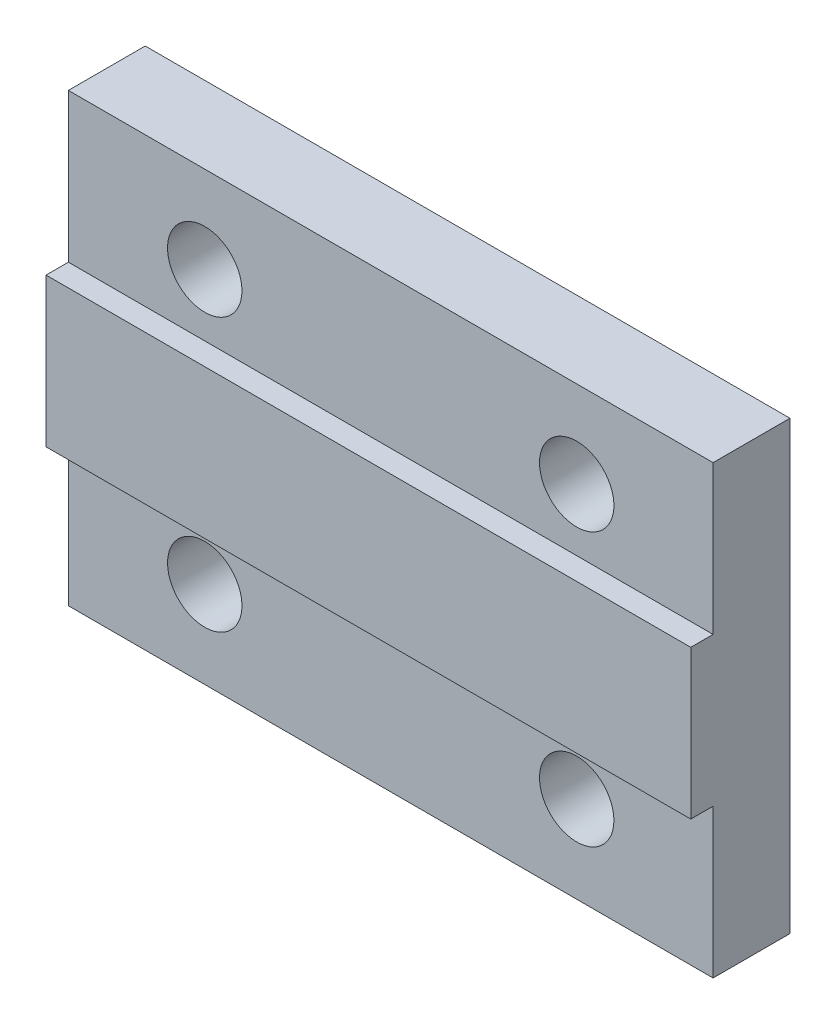
ISO-10303-21;
HEADER;
FILE_DESCRIPTION(('STEP AP214'),'2;1');
FILE_NAME('part.step','',(''),(''),'','','');
FILE_SCHEMA(('AUTOMOTIVE_DESIGN { 1 0 10303 214 1 1 1 1 }'));
ENDSEC;
DATA;
#1=APPLICATION_CONTEXT('core data for automotive mechanical design processes');
#2=APPLICATION_PROTOCOL_DEFINITION('international standard','automotive_design',2000,#1);
#3=PRODUCT_CONTEXT('',#1,'mechanical');
#4=PRODUCT('Part','Part','',(#3));
#5=PRODUCT_RELATED_PRODUCT_CATEGORY('part','',(#4));
#6=PRODUCT_DEFINITION_FORMATION('','',#4);
#7=PRODUCT_DEFINITION_CONTEXT('part definition',#1,'design');
#8=PRODUCT_DEFINITION('design','',#6,#7);
#9=PRODUCT_DEFINITION_SHAPE('','',#8);
#10=(LENGTH_UNIT() NAMED_UNIT(*) SI_UNIT(.MILLI.,.METRE.));
#11=(NAMED_UNIT(*) PLANE_ANGLE_UNIT() SI_UNIT($,.RADIAN.));
#12=(NAMED_UNIT(*) SI_UNIT($,.STERADIAN.) SOLID_ANGLE_UNIT());
#13=UNCERTAINTY_MEASURE_WITH_UNIT(LENGTH_MEASURE(1.E-05),#10,'distance_accuracy_value','');
#14=(GEOMETRIC_REPRESENTATION_CONTEXT(3) GLOBAL_UNCERTAINTY_ASSIGNED_CONTEXT((#13)) GLOBAL_UNIT_ASSIGNED_CONTEXT((#10,
#11,#12)) REPRESENTATION_CONTEXT('',''));
#15=CARTESIAN_POINT('',(0.,0.,0.));
#16=DIRECTION('',(0.,0.,1.));
#17=DIRECTION('',(1.,0.,0.));
#18=AXIS2_PLACEMENT_3D('',#15,#16,#17);
#19=CARTESIAN_POINT('',(0.,0.,4.));
#20=DIRECTION('',(1.,0.,0.));
#21=DIRECTION('',(0.,0.,-1.));
#22=AXIS2_PLACEMENT_3D('',#19,#20,#21);
#23=PLANE('',#22);
#24=DIRECTION('',(0.,1.,0.));
#25=VECTOR('',#24,1.);
#26=CARTESIAN_POINT('',(0.,0.,3.1));
#27=LINE('',#26,#25);
#28=CARTESIAN_POINT('',(0.,0.,3.1));
#29=VERTEX_POINT('',#28);
#30=CARTESIAN_POINT('',(0.,6.,3.1));
#31=VERTEX_POINT('',#30);
#32=EDGE_CURVE('E98',#29,#31,#27,.T.);
#33=ORIENTED_EDGE('',*,*,#32,.T.);
#34=DIRECTION('',(0.,0.,1.));
#35=VECTOR('',#34,1.);
#36=CARTESIAN_POINT('',(0.,6.,4.));
#37=LINE('',#36,#35);
#38=CARTESIAN_POINT('',(0.,6.,4.));
#39=VERTEX_POINT('',#38);
#40=EDGE_CURVE('E109',#31,#39,#37,.T.);
#41=ORIENTED_EDGE('',*,*,#40,.T.);
#42=DIRECTION('',(0.,-1.,0.));
#43=VECTOR('',#42,1.);
#44=CARTESIAN_POINT('',(0.,0.,4.));
#45=LINE('',#44,#43);
#46=CARTESIAN_POINT('',(0.,12.,4.));
#47=VERTEX_POINT('',#46);
#48=EDGE_CURVE('E142',#47,#39,#45,.T.);
#49=ORIENTED_EDGE('',*,*,#48,.F.);
#50=DIRECTION('',(0.,0.,-1.));
#51=VECTOR('',#50,1.);
#52=CARTESIAN_POINT('',(0.,12.,4.));
#53=LINE('',#52,#51);
#54=CARTESIAN_POINT('',(0.,12.,3.1));
#55=VERTEX_POINT('',#54);
#56=EDGE_CURVE('E57',#47,#55,#53,.T.);
#57=ORIENTED_EDGE('',*,*,#56,.T.);
#58=DIRECTION('',(0.,1.,0.));
#59=VECTOR('',#58,1.);
#60=CARTESIAN_POINT('',(0.,18.,3.1));
#61=LINE('',#60,#59);
#62=CARTESIAN_POINT('',(0.,18.,3.1));
#63=VERTEX_POINT('',#62);
#64=EDGE_CURVE('E161',#55,#63,#61,.T.);
#65=ORIENTED_EDGE('',*,*,#64,.T.);
#66=DIRECTION('',(0.,0.,-1.));
#67=VECTOR('',#66,1.);
#68=CARTESIAN_POINT('',(0.,18.,4.));
#69=LINE('',#68,#67);
#70=CARTESIAN_POINT('',(0.,18.,0.));
#71=VERTEX_POINT('',#70);
#72=EDGE_CURVE('E122',#63,#71,#69,.T.);
#73=ORIENTED_EDGE('',*,*,#72,.T.);
#74=DIRECTION('',(0.,-1.,0.));
#75=VECTOR('',#74,1.);
#76=CARTESIAN_POINT('',(0.,0.,0.));
#77=LINE('',#76,#75);
#78=CARTESIAN_POINT('',(0.,0.,0.));
#79=VERTEX_POINT('',#78);
#80=EDGE_CURVE('E119',#71,#79,#77,.T.);
#81=ORIENTED_EDGE('',*,*,#80,.T.);
#82=DIRECTION('',(0.,0.,-1.));
#83=VECTOR('',#82,1.);
#84=CARTESIAN_POINT('',(0.,0.,4.));
#85=LINE('',#84,#83);
#86=EDGE_CURVE('E11',#29,#79,#85,.T.);
#87=ORIENTED_EDGE('',*,*,#86,.F.);
#88=EDGE_LOOP('',(#33,#41,#49,#57,#65,#73,#81,#87));
#89=FACE_BOUND('',#88,.T.);
#90=ADVANCED_FACE('F35',(#89),#23,.F.);
#91=CARTESIAN_POINT('',(0.,0.,4.));
#92=DIRECTION('',(0.,1.,0.));
#93=DIRECTION('',(0.,0.,1.));
#94=AXIS2_PLACEMENT_3D('',#91,#92,#93);
#95=PLANE('',#94);
#96=DIRECTION('',(0.,0.,-1.));
#97=VECTOR('',#96,1.);
#98=CARTESIAN_POINT('',(26.,0.,4.));
#99=LINE('',#98,#97);
#100=CARTESIAN_POINT('',(26.,0.,3.1));
#101=VERTEX_POINT('',#100);
#102=CARTESIAN_POINT('',(26.,0.,0.));
#103=VERTEX_POINT('',#102);
#104=EDGE_CURVE('E42',#101,#103,#99,.T.);
#105=ORIENTED_EDGE('',*,*,#104,.F.);
#106=DIRECTION('',(1.,0.,0.));
#107=VECTOR('',#106,1.);
#108=CARTESIAN_POINT('',(0.,0.,3.1));
#109=LINE('',#108,#107);
#110=EDGE_CURVE('E102',#29,#101,#109,.T.);
#111=ORIENTED_EDGE('',*,*,#110,.F.);
#112=ORIENTED_EDGE('',*,*,#86,.T.);
#113=DIRECTION('',(1.,0.,0.));
#114=VECTOR('',#113,1.);
#115=CARTESIAN_POINT('',(0.,0.,0.));
#116=LINE('',#115,#114);
#117=EDGE_CURVE('E126',#79,#103,#116,.T.);
#118=ORIENTED_EDGE('',*,*,#117,.T.);
#119=EDGE_LOOP('',(#105,#111,#112,#118));
#120=FACE_BOUND('',#119,.T.);
#121=ADVANCED_FACE('F113',(#120),#95,.F.);
#122=CARTESIAN_POINT('',(26.,0.,4.));
#123=DIRECTION('',(-1.,0.,0.));
#124=DIRECTION('',(0.,0.,1.));
#125=AXIS2_PLACEMENT_3D('',#122,#123,#124);
#126=PLANE('',#125);
#127=DIRECTION('',(0.,1.,0.));
#128=VECTOR('',#127,1.);
#129=CARTESIAN_POINT('',(26.,0.,4.));
#130=LINE('',#129,#128);
#131=CARTESIAN_POINT('',(26.,6.,4.));
#132=VERTEX_POINT('',#131);
#133=CARTESIAN_POINT('',(26.,12.,4.));
#134=VERTEX_POINT('',#133);
#135=EDGE_CURVE('E135',#132,#134,#130,.T.);
#136=ORIENTED_EDGE('',*,*,#135,.F.);
#137=DIRECTION('',(0.,0.,1.));
#138=VECTOR('',#137,1.);
#139=CARTESIAN_POINT('',(26.,6.,4.));
#140=LINE('',#139,#138);
#141=CARTESIAN_POINT('',(26.,6.,3.1));
#142=VERTEX_POINT('',#141);
#143=EDGE_CURVE('E49',#142,#132,#140,.T.);
#144=ORIENTED_EDGE('',*,*,#143,.F.);
#145=DIRECTION('',(0.,1.,0.));
#146=VECTOR('',#145,1.);
#147=CARTESIAN_POINT('',(26.,0.,3.1));
#148=LINE('',#147,#146);
#149=EDGE_CURVE('E150',#101,#142,#148,.T.);
#150=ORIENTED_EDGE('',*,*,#149,.F.);
#151=ORIENTED_EDGE('',*,*,#104,.T.);
#152=DIRECTION('',(0.,1.,0.));
#153=VECTOR('',#152,1.);
#154=CARTESIAN_POINT('',(26.,0.,0.));
#155=LINE('',#154,#153);
#156=CARTESIAN_POINT('',(26.,18.,0.));
#157=VERTEX_POINT('',#156);
#158=EDGE_CURVE('E129',#103,#157,#155,.T.);
#159=ORIENTED_EDGE('',*,*,#158,.T.);
#160=DIRECTION('',(0.,0.,-1.));
#161=VECTOR('',#160,1.);
#162=CARTESIAN_POINT('',(26.,18.,4.));
#163=LINE('',#162,#161);
#164=CARTESIAN_POINT('',(26.,18.,3.1));
#165=VERTEX_POINT('',#164);
#166=EDGE_CURVE('E144',#165,#157,#163,.T.);
#167=ORIENTED_EDGE('',*,*,#166,.F.);
#168=DIRECTION('',(0.,1.,0.));
#169=VECTOR('',#168,1.);
#170=CARTESIAN_POINT('',(26.,18.,3.1));
#171=LINE('',#170,#169);
#172=CARTESIAN_POINT('',(26.,12.,3.1));
#173=VERTEX_POINT('',#172);
#174=EDGE_CURVE('E156',#173,#165,#171,.T.);
#175=ORIENTED_EDGE('',*,*,#174,.F.);
#176=DIRECTION('',(0.,0.,-1.));
#177=VECTOR('',#176,1.);
#178=CARTESIAN_POINT('',(26.,12.,4.));
#179=LINE('',#178,#177);
#180=EDGE_CURVE('E158',#134,#173,#179,.T.);
#181=ORIENTED_EDGE('',*,*,#180,.F.);
#182=EDGE_LOOP('',(#136,#144,#150,#151,#159,#167,#175,#181));
#183=FACE_BOUND('',#182,.T.);
#184=ADVANCED_FACE('F147',(#183),#126,.F.);
#185=CARTESIAN_POINT('',(0.,18.,4.));
#186=DIRECTION('',(0.,-1.,0.));
#187=DIRECTION('',(0.,0.,-1.));
#188=AXIS2_PLACEMENT_3D('',#185,#186,#187);
#189=PLANE('',#188);
#190=ORIENTED_EDGE('',*,*,#72,.F.);
#191=DIRECTION('',(1.,0.,0.));
#192=VECTOR('',#191,1.);
#193=CARTESIAN_POINT('',(0.,18.,3.1));
#194=LINE('',#193,#192);
#195=EDGE_CURVE('E127',#63,#165,#194,.T.);
#196=ORIENTED_EDGE('',*,*,#195,.T.);
#197=ORIENTED_EDGE('',*,*,#166,.T.);
#198=DIRECTION('',(-1.,0.,0.));
#199=VECTOR('',#198,1.);
#200=CARTESIAN_POINT('',(0.,18.,0.));
#201=LINE('',#200,#199);
#202=EDGE_CURVE('E140',#157,#71,#201,.T.);
#203=ORIENTED_EDGE('',*,*,#202,.T.);
#204=EDGE_LOOP('',(#190,#196,#197,#203));
#205=FACE_BOUND('',#204,.T.);
#206=ADVANCED_FACE('F153',(#205),#189,.F.);
#207=CARTESIAN_POINT('',(0.,0.,4.));
#208=DIRECTION('',(0.,0.,-1.));
#209=DIRECTION('',(-1.,0.,0.));
#210=AXIS2_PLACEMENT_3D('',#207,#208,#209);
#211=PLANE('',#210);
#212=ORIENTED_EDGE('',*,*,#48,.T.);
#213=DIRECTION('',(1.,0.,0.));
#214=VECTOR('',#213,1.);
#215=CARTESIAN_POINT('',(0.,6.,4.));
#216=LINE('',#215,#214);
#217=EDGE_CURVE('E163',#39,#132,#216,.T.);
#218=ORIENTED_EDGE('',*,*,#217,.T.);
#219=ORIENTED_EDGE('',*,*,#135,.T.);
#220=DIRECTION('',(1.,0.,0.));
#221=VECTOR('',#220,1.);
#222=CARTESIAN_POINT('',(0.,12.,4.));
#223=LINE('',#222,#221);
#224=EDGE_CURVE('E168',#47,#134,#223,.T.);
#225=ORIENTED_EDGE('',*,*,#224,.F.);
#226=EDGE_LOOP('',(#212,#218,#219,#225));
#227=FACE_BOUND('',#226,.T.);
#228=ADVANCED_FACE('F172',(#227),#211,.F.);
#229=CARTESIAN_POINT('',(0.,0.,0.));
#230=DIRECTION('',(0.,0.,-1.));
#231=DIRECTION('',(-1.,0.,0.));
#232=AXIS2_PLACEMENT_3D('',#229,#230,#231);
#233=PLANE('',#232);
#234=CARTESIAN_POINT('',(5.5,3.5,0.));
#235=DIRECTION('',(0.,0.,-1.));
#236=DIRECTION('',(-1.,0.,0.));
#237=AXIS2_PLACEMENT_3D('',#234,#235,#236);
#238=CIRCLE('',#237,1.5);
#239=CARTESIAN_POINT('',(4.,3.5,0.));
#240=VERTEX_POINT('',#239);
#241=EDGE_CURVE('E227',#240,#240,#238,.T.);
#242=ORIENTED_EDGE('',*,*,#241,.F.);
#243=EDGE_LOOP('',(#242));
#244=FACE_BOUND('',#243,.T.);
#245=CARTESIAN_POINT('',(20.5,3.5,0.));
#246=DIRECTION('',(0.,0.,-1.));
#247=DIRECTION('',(-1.,0.,0.));
#248=AXIS2_PLACEMENT_3D('',#245,#246,#247);
#249=CIRCLE('',#248,1.5);
#250=CARTESIAN_POINT('',(19.,3.5,0.));
#251=VERTEX_POINT('',#250);
#252=EDGE_CURVE('E232',#251,#251,#249,.T.);
#253=ORIENTED_EDGE('',*,*,#252,.F.);
#254=EDGE_LOOP('',(#253));
#255=FACE_BOUND('',#254,.T.);
#256=CARTESIAN_POINT('',(20.5,14.5,0.));
#257=DIRECTION('',(0.,0.,-1.));
#258=DIRECTION('',(-1.,0.,0.));
#259=AXIS2_PLACEMENT_3D('',#256,#257,#258);
#260=CIRCLE('',#259,1.5);
#261=CARTESIAN_POINT('',(19.,14.5,0.));
#262=VERTEX_POINT('',#261);
#263=EDGE_CURVE('E223',#262,#262,#260,.T.);
#264=ORIENTED_EDGE('',*,*,#263,.F.);
#265=EDGE_LOOP('',(#264));
#266=FACE_BOUND('',#265,.T.);
#267=CARTESIAN_POINT('',(5.5,14.5,0.));
#268=DIRECTION('',(0.,0.,-1.));
#269=DIRECTION('',(-1.,0.,0.));
#270=AXIS2_PLACEMENT_3D('',#267,#268,#269);
#271=CIRCLE('',#270,1.5);
#272=CARTESIAN_POINT('',(4.,14.5,0.));
#273=VERTEX_POINT('',#272);
#274=EDGE_CURVE('E180',#273,#273,#271,.T.);
#275=ORIENTED_EDGE('',*,*,#274,.F.);
#276=EDGE_LOOP('',(#275));
#277=FACE_BOUND('',#276,.T.);
#278=ORIENTED_EDGE('',*,*,#80,.F.);
#279=ORIENTED_EDGE('',*,*,#202,.F.);
#280=ORIENTED_EDGE('',*,*,#158,.F.);
#281=ORIENTED_EDGE('',*,*,#117,.F.);
#282=EDGE_LOOP('',(#278,#279,#280,#281));
#283=FACE_BOUND('',#282,.T.);
#284=ADVANCED_FACE('F151',(#244,#255,#266,#277,#283),#233,.T.);
#285=CARTESIAN_POINT('',(0.,18.,3.1));
#286=DIRECTION('',(0.,0.,-1.));
#287=DIRECTION('',(0.,1.,0.));
#288=AXIS2_PLACEMENT_3D('',#285,#286,#287);
#289=PLANE('',#288);
#290=CARTESIAN_POINT('',(20.5,14.5,3.1));
#291=DIRECTION('',(0.,0.,1.));
#292=DIRECTION('',(-1.,0.,0.));
#293=AXIS2_PLACEMENT_3D('',#290,#291,#292);
#294=CIRCLE('',#293,1.5);
#295=CARTESIAN_POINT('',(19.,14.5,3.1));
#296=VERTEX_POINT('',#295);
#297=EDGE_CURVE('E218',#296,#296,#294,.T.);
#298=ORIENTED_EDGE('',*,*,#297,.F.);
#299=EDGE_LOOP('',(#298));
#300=FACE_BOUND('',#299,.T.);
#301=CARTESIAN_POINT('',(5.5,14.5,3.1));
#302=DIRECTION('',(0.,0.,1.));
#303=DIRECTION('',(1.,0.,0.));
#304=AXIS2_PLACEMENT_3D('',#301,#302,#303);
#305=CIRCLE('',#304,1.5);
#306=CARTESIAN_POINT('',(7.,14.5,3.1));
#307=VERTEX_POINT('',#306);
#308=EDGE_CURVE('E221',#307,#307,#305,.T.);
#309=ORIENTED_EDGE('',*,*,#308,.F.);
#310=EDGE_LOOP('',(#309));
#311=FACE_BOUND('',#310,.T.);
#312=ORIENTED_EDGE('',*,*,#174,.T.);
#313=ORIENTED_EDGE('',*,*,#195,.F.);
#314=ORIENTED_EDGE('',*,*,#64,.F.);
#315=DIRECTION('',(1.,0.,0.));
#316=VECTOR('',#315,1.);
#317=CARTESIAN_POINT('',(0.,12.,3.1));
#318=LINE('',#317,#316);
#319=EDGE_CURVE('E132',#55,#173,#318,.T.);
#320=ORIENTED_EDGE('',*,*,#319,.T.);
#321=EDGE_LOOP('',(#312,#313,#314,#320));
#322=FACE_BOUND('',#321,.T.);
#323=ADVANCED_FACE('F175',(#300,#311,#322),#289,.F.);
#324=CARTESIAN_POINT('',(0.,12.,4.));
#325=DIRECTION('',(0.,-1.,0.));
#326=DIRECTION('',(0.,0.,-1.));
#327=AXIS2_PLACEMENT_3D('',#324,#325,#326);
#328=PLANE('',#327);
#329=ORIENTED_EDGE('',*,*,#180,.T.);
#330=ORIENTED_EDGE('',*,*,#319,.F.);
#331=ORIENTED_EDGE('',*,*,#56,.F.);
#332=ORIENTED_EDGE('',*,*,#224,.T.);
#333=EDGE_LOOP('',(#329,#330,#331,#332));
#334=FACE_BOUND('',#333,.T.);
#335=ADVANCED_FACE('F173',(#334),#328,.F.);
#336=CARTESIAN_POINT('',(0.,6.,4.));
#337=DIRECTION('',(0.,1.,0.));
#338=DIRECTION('',(0.,0.,1.));
#339=AXIS2_PLACEMENT_3D('',#336,#337,#338);
#340=PLANE('',#339);
#341=ORIENTED_EDGE('',*,*,#143,.T.);
#342=ORIENTED_EDGE('',*,*,#217,.F.);
#343=ORIENTED_EDGE('',*,*,#40,.F.);
#344=DIRECTION('',(1.,0.,0.));
#345=VECTOR('',#344,1.);
#346=CARTESIAN_POINT('',(0.,6.,3.1));
#347=LINE('',#346,#345);
#348=EDGE_CURVE('E104',#31,#142,#347,.T.);
#349=ORIENTED_EDGE('',*,*,#348,.T.);
#350=EDGE_LOOP('',(#341,#342,#343,#349));
#351=FACE_BOUND('',#350,.T.);
#352=ADVANCED_FACE('F183',(#351),#340,.F.);
#353=CARTESIAN_POINT('',(0.,0.,3.1));
#354=DIRECTION('',(0.,0.,-1.));
#355=DIRECTION('',(0.,1.,0.));
#356=AXIS2_PLACEMENT_3D('',#353,#354,#355);
#357=PLANE('',#356);
#358=CARTESIAN_POINT('',(5.5,3.5,3.1));
#359=DIRECTION('',(0.,0.,1.));
#360=DIRECTION('',(-1.,0.,0.));
#361=AXIS2_PLACEMENT_3D('',#358,#359,#360);
#362=CIRCLE('',#361,1.5);
#363=CARTESIAN_POINT('',(4.,3.5,3.1));
#364=VERTEX_POINT('',#363);
#365=EDGE_CURVE('E235',#364,#364,#362,.T.);
#366=ORIENTED_EDGE('',*,*,#365,.F.);
#367=EDGE_LOOP('',(#366));
#368=FACE_BOUND('',#367,.T.);
#369=CARTESIAN_POINT('',(20.5,3.5,3.1));
#370=DIRECTION('',(0.,0.,1.));
#371=DIRECTION('',(1.,0.,0.));
#372=AXIS2_PLACEMENT_3D('',#369,#370,#371);
#373=CIRCLE('',#372,1.5);
#374=CARTESIAN_POINT('',(22.,3.5,3.1));
#375=VERTEX_POINT('',#374);
#376=EDGE_CURVE('E237',#375,#375,#373,.T.);
#377=ORIENTED_EDGE('',*,*,#376,.F.);
#378=EDGE_LOOP('',(#377));
#379=FACE_BOUND('',#378,.T.);
#380=ORIENTED_EDGE('',*,*,#149,.T.);
#381=ORIENTED_EDGE('',*,*,#348,.F.);
#382=ORIENTED_EDGE('',*,*,#32,.F.);
#383=ORIENTED_EDGE('',*,*,#110,.T.);
#384=EDGE_LOOP('',(#380,#381,#382,#383));
#385=FACE_BOUND('',#384,.T.);
#386=ADVANCED_FACE('F101',(#368,#379,#385),#357,.F.);
#387=CARTESIAN_POINT('',(5.5,14.5,-0.899999999999999));
#388=DIRECTION('',(0.,0.,1.));
#389=DIRECTION('',(1.,0.,0.));
#390=AXIS2_PLACEMENT_3D('',#387,#388,#389);
#391=CYLINDRICAL_SURFACE('',#390,1.5);
#392=ORIENTED_EDGE('',*,*,#274,.T.);
#393=EDGE_LOOP('',(#392));
#394=FACE_BOUND('',#393,.T.);
#395=ORIENTED_EDGE('',*,*,#308,.T.);
#396=EDGE_LOOP('',(#395));
#397=FACE_BOUND('',#396,.T.);
#398=ADVANCED_FACE('F190',(#394,#397),#391,.F.);
#399=CARTESIAN_POINT('',(20.5,3.5,-0.899999999999999));
#400=DIRECTION('',(0.,0.,1.));
#401=DIRECTION('',(1.,0.,0.));
#402=AXIS2_PLACEMENT_3D('',#399,#400,#401);
#403=CYLINDRICAL_SURFACE('',#402,1.5);
#404=ORIENTED_EDGE('',*,*,#252,.T.);
#405=EDGE_LOOP('',(#404));
#406=FACE_BOUND('',#405,.T.);
#407=ORIENTED_EDGE('',*,*,#376,.T.);
#408=EDGE_LOOP('',(#407));
#409=FACE_BOUND('',#408,.T.);
#410=ADVANCED_FACE('F247',(#406,#409),#403,.F.);
#411=CARTESIAN_POINT('',(5.5,3.5,-0.899999999999999));
#412=DIRECTION('',(0.,0.,1.));
#413=DIRECTION('',(1.,0.,0.));
#414=AXIS2_PLACEMENT_3D('',#411,#412,#413);
#415=CYLINDRICAL_SURFACE('',#414,1.5);
#416=ORIENTED_EDGE('',*,*,#241,.T.);
#417=EDGE_LOOP('',(#416));
#418=FACE_BOUND('',#417,.T.);
#419=ORIENTED_EDGE('',*,*,#365,.T.);
#420=EDGE_LOOP('',(#419));
#421=FACE_BOUND('',#420,.T.);
#422=ADVANCED_FACE('F243',(#418,#421),#415,.F.);
#423=CARTESIAN_POINT('',(20.5,14.5,-0.899999999999999));
#424=DIRECTION('',(0.,0.,1.));
#425=DIRECTION('',(1.,0.,0.));
#426=AXIS2_PLACEMENT_3D('',#423,#424,#425);
#427=CYLINDRICAL_SURFACE('',#426,1.5);
#428=ORIENTED_EDGE('',*,*,#263,.T.);
#429=EDGE_LOOP('',(#428));
#430=FACE_BOUND('',#429,.T.);
#431=ORIENTED_EDGE('',*,*,#297,.T.);
#432=EDGE_LOOP('',(#431));
#433=FACE_BOUND('',#432,.T.);
#434=ADVANCED_FACE('F255',(#430,#433),#427,.F.);
#435=CLOSED_SHELL('',(#90,#121,#184,#206,#228,#284,#323,#335,#352,#386,#398,#410,#422,#434));
#436=MANIFOLD_SOLID_BREP('B2',#435);
#437=ADVANCED_BREP_SHAPE_REPRESENTATION('',(#18,#436),#14);
#438=SHAPE_DEFINITION_REPRESENTATION(#9,#437);
ENDSEC;
END-ISO-10303-21;
